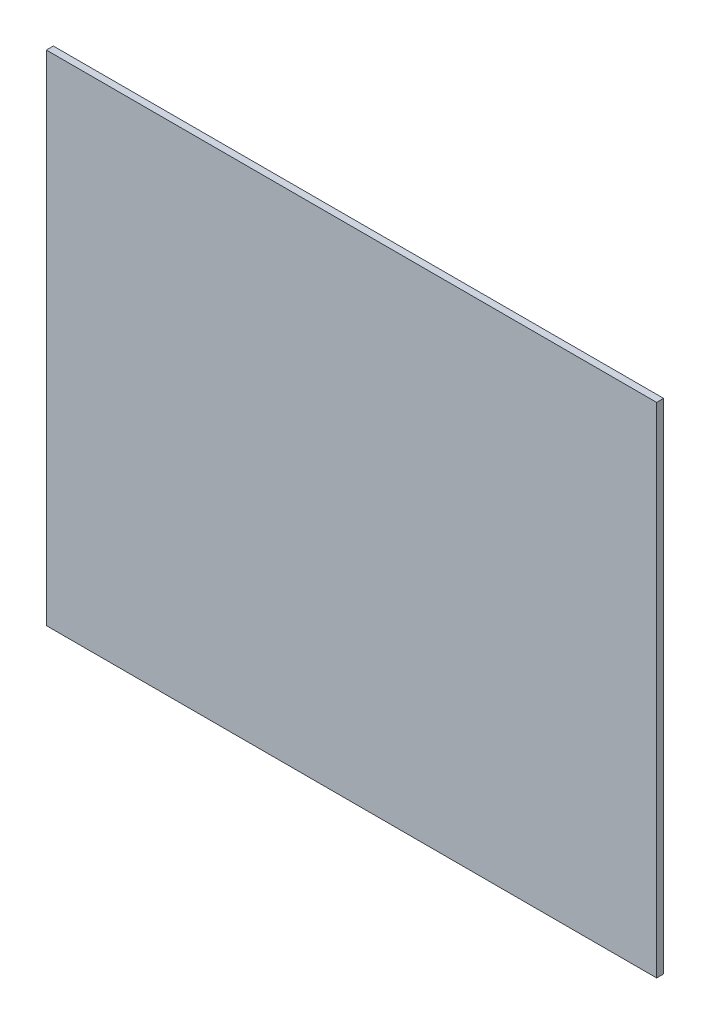
ISO-10303-21;
HEADER;
FILE_DESCRIPTION(('STEP AP214'),'2;1');
FILE_NAME('part.step','',(''),(''),'','','');
FILE_SCHEMA(('AUTOMOTIVE_DESIGN { 1 0 10303 214 1 1 1 1 }'));
ENDSEC;
DATA;
#1=APPLICATION_CONTEXT('core data for automotive mechanical design processes');
#2=APPLICATION_PROTOCOL_DEFINITION('international standard','automotive_design',2000,#1);
#3=PRODUCT_CONTEXT('',#1,'mechanical');
#4=PRODUCT('Part','Part','',(#3));
#5=PRODUCT_RELATED_PRODUCT_CATEGORY('part','',(#4));
#6=PRODUCT_DEFINITION_FORMATION('','',#4);
#7=PRODUCT_DEFINITION_CONTEXT('part definition',#1,'design');
#8=PRODUCT_DEFINITION('design','',#6,#7);
#9=PRODUCT_DEFINITION_SHAPE('','',#8);
#10=(LENGTH_UNIT() NAMED_UNIT(*) SI_UNIT(.MILLI.,.METRE.));
#11=(NAMED_UNIT(*) PLANE_ANGLE_UNIT() SI_UNIT($,.RADIAN.));
#12=(NAMED_UNIT(*) SI_UNIT($,.STERADIAN.) SOLID_ANGLE_UNIT());
#13=UNCERTAINTY_MEASURE_WITH_UNIT(LENGTH_MEASURE(1.E-05),#10,'distance_accuracy_value','');
#14=(GEOMETRIC_REPRESENTATION_CONTEXT(3) GLOBAL_UNCERTAINTY_ASSIGNED_CONTEXT((#13)) GLOBAL_UNIT_ASSIGNED_CONTEXT((#10,
#11,#12)) REPRESENTATION_CONTEXT('',''));
#15=CARTESIAN_POINT('',(0.,0.,0.));
#16=DIRECTION('',(0.,0.,1.));
#17=DIRECTION('',(1.,0.,0.));
#18=AXIS2_PLACEMENT_3D('',#15,#16,#17);
#19=CARTESIAN_POINT('',(-55.0355249406901,36.5593129963155,1.5));
#20=DIRECTION('',(1.,0.,0.));
#21=DIRECTION('',(0.,1.,0.));
#22=AXIS2_PLACEMENT_3D('',#19,#20,#21);
#23=PLANE('',#22);
#24=DIRECTION('',(0.,-1.,0.));
#25=VECTOR('',#24,1.);
#26=CARTESIAN_POINT('',(-55.0355249406901,36.5593129963155,0.));
#27=LINE('',#26,#25);
#28=CARTESIAN_POINT('',(-55.0355249406901,36.5593129963155,0.));
#29=VERTEX_POINT('',#28);
#30=CARTESIAN_POINT('',(-55.03552494069,-70.4406870036845,0.));
#31=VERTEX_POINT('',#30);
#32=EDGE_CURVE('E98',#29,#31,#27,.T.);
#33=ORIENTED_EDGE('',*,*,#32,.T.);
#34=DIRECTION('',(0.,0.,-1.));
#35=VECTOR('',#34,1.);
#36=CARTESIAN_POINT('',(-55.03552494069,-70.4406870036845,1.5));
#37=LINE('',#36,#35);
#38=CARTESIAN_POINT('',(-55.03552494069,-70.4406870036845,1.5));
#39=VERTEX_POINT('',#38);
#40=EDGE_CURVE('E11',#39,#31,#37,.T.);
#41=ORIENTED_EDGE('',*,*,#40,.F.);
#42=DIRECTION('',(0.,-1.,0.));
#43=VECTOR('',#42,1.);
#44=CARTESIAN_POINT('',(-55.0355249406901,36.5593129963155,1.5));
#45=LINE('',#44,#43);
#46=CARTESIAN_POINT('',(-55.0355249406901,36.5593129963155,1.5));
#47=VERTEX_POINT('',#46);
#48=EDGE_CURVE('E86',#47,#39,#45,.T.);
#49=ORIENTED_EDGE('',*,*,#48,.F.);
#50=DIRECTION('',(0.,0.,-1.));
#51=VECTOR('',#50,1.);
#52=CARTESIAN_POINT('',(-55.0355249406901,36.5593129963155,1.5));
#53=LINE('',#52,#51);
#54=EDGE_CURVE('E94',#47,#29,#53,.T.);
#55=ORIENTED_EDGE('',*,*,#54,.T.);
#56=EDGE_LOOP('',(#33,#41,#49,#55));
#57=FACE_BOUND('',#56,.T.);
#58=ADVANCED_FACE('F35',(#57),#23,.F.);
#59=CARTESIAN_POINT('',(-55.03552494069,-70.4406870036845,1.5));
#60=DIRECTION('',(0.,1.,0.));
#61=DIRECTION('',(0.,0.,1.));
#62=AXIS2_PLACEMENT_3D('',#59,#60,#61);
#63=PLANE('',#62);
#64=DIRECTION('',(1.,0.,0.));
#65=VECTOR('',#64,1.);
#66=CARTESIAN_POINT('',(-55.03552494069,-70.4406870036845,0.));
#67=LINE('',#66,#65);
#68=CARTESIAN_POINT('',(75.96447505931,-70.4406870036845,0.));
#69=VERTEX_POINT('',#68);
#70=EDGE_CURVE('E90',#31,#69,#67,.T.);
#71=ORIENTED_EDGE('',*,*,#70,.T.);
#72=DIRECTION('',(0.,0.,-1.));
#73=VECTOR('',#72,1.);
#74=CARTESIAN_POINT('',(75.96447505931,-70.4406870036845,1.5));
#75=LINE('',#74,#73);
#76=CARTESIAN_POINT('',(75.96447505931,-70.4406870036845,1.5));
#77=VERTEX_POINT('',#76);
#78=EDGE_CURVE('E43',#77,#69,#75,.T.);
#79=ORIENTED_EDGE('',*,*,#78,.F.);
#80=DIRECTION('',(1.,0.,0.));
#81=VECTOR('',#80,1.);
#82=CARTESIAN_POINT('',(-55.03552494069,-70.4406870036845,1.5));
#83=LINE('',#82,#81);
#84=EDGE_CURVE('E81',#39,#77,#83,.T.);
#85=ORIENTED_EDGE('',*,*,#84,.F.);
#86=ORIENTED_EDGE('',*,*,#40,.T.);
#87=EDGE_LOOP('',(#71,#79,#85,#86));
#88=FACE_BOUND('',#87,.T.);
#89=ADVANCED_FACE('F89',(#88),#63,.F.);
#90=CARTESIAN_POINT('',(75.9644750593099,36.5593129963155,1.5));
#91=DIRECTION('',(-1.,0.,0.));
#92=DIRECTION('',(0.,-1.,0.));
#93=AXIS2_PLACEMENT_3D('',#90,#91,#92);
#94=PLANE('',#93);
#95=DIRECTION('',(0.,1.,0.));
#96=VECTOR('',#95,1.);
#97=CARTESIAN_POINT('',(75.9644750593099,36.5593129963155,0.));
#98=LINE('',#97,#96);
#99=CARTESIAN_POINT('',(75.9644750593099,36.5593129963155,0.));
#100=VERTEX_POINT('',#99);
#101=EDGE_CURVE('E68',#69,#100,#98,.T.);
#102=ORIENTED_EDGE('',*,*,#101,.T.);
#103=DIRECTION('',(0.,0.,-1.));
#104=VECTOR('',#103,1.);
#105=CARTESIAN_POINT('',(75.9644750593099,36.5593129963155,1.5));
#106=LINE('',#105,#104);
#107=CARTESIAN_POINT('',(75.9644750593099,36.5593129963155,1.5));
#108=VERTEX_POINT('',#107);
#109=EDGE_CURVE('E91',#108,#100,#106,.T.);
#110=ORIENTED_EDGE('',*,*,#109,.F.);
#111=DIRECTION('',(0.,1.,0.));
#112=VECTOR('',#111,1.);
#113=CARTESIAN_POINT('',(75.9644750593099,36.5593129963155,1.5));
#114=LINE('',#113,#112);
#115=EDGE_CURVE('E84',#77,#108,#114,.T.);
#116=ORIENTED_EDGE('',*,*,#115,.F.);
#117=ORIENTED_EDGE('',*,*,#78,.T.);
#118=EDGE_LOOP('',(#102,#110,#116,#117));
#119=FACE_BOUND('',#118,.T.);
#120=ADVANCED_FACE('F92',(#119),#94,.F.);
#121=CARTESIAN_POINT('',(-55.0355249406901,36.5593129963155,1.5));
#122=DIRECTION('',(0.,-1.,0.));
#123=DIRECTION('',(0.,0.,-1.));
#124=AXIS2_PLACEMENT_3D('',#121,#122,#123);
#125=PLANE('',#124);
#126=DIRECTION('',(-1.,0.,0.));
#127=VECTOR('',#126,1.);
#128=CARTESIAN_POINT('',(-55.0355249406901,36.5593129963155,0.));
#129=LINE('',#128,#127);
#130=EDGE_CURVE('E74',#100,#29,#129,.T.);
#131=ORIENTED_EDGE('',*,*,#130,.T.);
#132=ORIENTED_EDGE('',*,*,#54,.F.);
#133=DIRECTION('',(-1.,0.,0.));
#134=VECTOR('',#133,1.);
#135=CARTESIAN_POINT('',(-55.0355249406901,36.5593129963155,1.5));
#136=LINE('',#135,#134);
#137=EDGE_CURVE('E51',#108,#47,#136,.T.);
#138=ORIENTED_EDGE('',*,*,#137,.F.);
#139=ORIENTED_EDGE('',*,*,#109,.T.);
#140=EDGE_LOOP('',(#131,#132,#138,#139));
#141=FACE_BOUND('',#140,.T.);
#142=ADVANCED_FACE('F105',(#141),#125,.F.);
#143=CARTESIAN_POINT('',(0.,0.,1.5));
#144=DIRECTION('',(0.,0.,1.));
#145=DIRECTION('',(1.,0.,0.));
#146=AXIS2_PLACEMENT_3D('',#143,#144,#145);
#147=PLANE('',#146);
#148=ORIENTED_EDGE('',*,*,#48,.T.);
#149=ORIENTED_EDGE('',*,*,#84,.T.);
#150=ORIENTED_EDGE('',*,*,#115,.T.);
#151=ORIENTED_EDGE('',*,*,#137,.T.);
#152=EDGE_LOOP('',(#148,#149,#150,#151));
#153=FACE_BOUND('',#152,.T.);
#154=ADVANCED_FACE('F82',(#153),#147,.T.);
#155=CARTESIAN_POINT('',(0.,0.,0.));
#156=DIRECTION('',(0.,0.,1.));
#157=DIRECTION('',(1.,0.,0.));
#158=AXIS2_PLACEMENT_3D('',#155,#156,#157);
#159=PLANE('',#158);
#160=ORIENTED_EDGE('',*,*,#32,.F.);
#161=ORIENTED_EDGE('',*,*,#130,.F.);
#162=ORIENTED_EDGE('',*,*,#101,.F.);
#163=ORIENTED_EDGE('',*,*,#70,.F.);
#164=EDGE_LOOP('',(#160,#161,#162,#163));
#165=FACE_BOUND('',#164,.T.);
#166=ADVANCED_FACE('F108',(#165),#159,.F.);
#167=CLOSED_SHELL('',(#58,#89,#120,#142,#154,#166));
#168=MANIFOLD_SOLID_BREP('B2',#167);
#169=ADVANCED_BREP_SHAPE_REPRESENTATION('',(#18,#168),#14);
#170=SHAPE_DEFINITION_REPRESENTATION(#9,#169);
ENDSEC;
END-ISO-10303-21;
